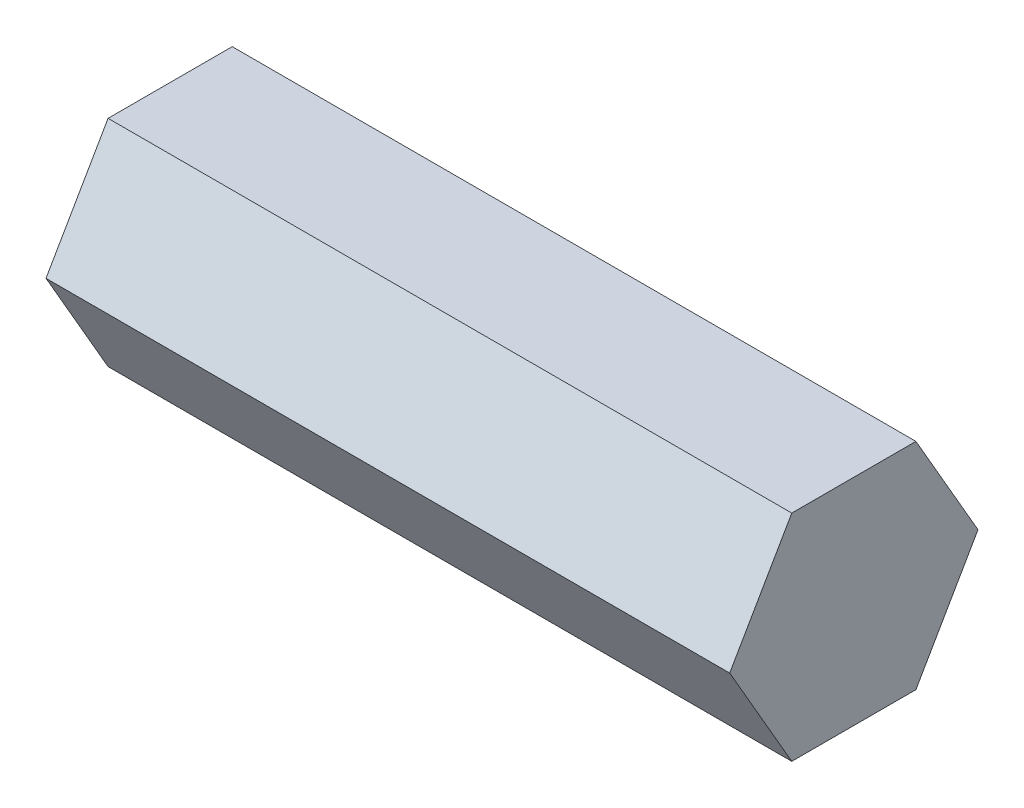
ISO-10303-21;
HEADER;
FILE_DESCRIPTION(('STEP AP214'),'2;1');
FILE_NAME('part.step','',(''),(''),'','','');
FILE_SCHEMA(('AUTOMOTIVE_DESIGN { 1 0 10303 214 1 1 1 1 }'));
ENDSEC;
DATA;
#1=APPLICATION_CONTEXT('core data for automotive mechanical design processes');
#2=APPLICATION_PROTOCOL_DEFINITION('international standard','automotive_design',2000,#1);
#3=PRODUCT_CONTEXT('',#1,'mechanical');
#4=PRODUCT('Part','Part','',(#3));
#5=PRODUCT_RELATED_PRODUCT_CATEGORY('part','',(#4));
#6=PRODUCT_DEFINITION_FORMATION('','',#4);
#7=PRODUCT_DEFINITION_CONTEXT('part definition',#1,'design');
#8=PRODUCT_DEFINITION('design','',#6,#7);
#9=PRODUCT_DEFINITION_SHAPE('','',#8);
#10=(LENGTH_UNIT() NAMED_UNIT(*) SI_UNIT(.MILLI.,.METRE.));
#11=(NAMED_UNIT(*) PLANE_ANGLE_UNIT() SI_UNIT($,.RADIAN.));
#12=(NAMED_UNIT(*) SI_UNIT($,.STERADIAN.) SOLID_ANGLE_UNIT());
#13=UNCERTAINTY_MEASURE_WITH_UNIT(LENGTH_MEASURE(1.E-05),#10,'distance_accuracy_value','');
#14=(GEOMETRIC_REPRESENTATION_CONTEXT(3) GLOBAL_UNCERTAINTY_ASSIGNED_CONTEXT((#13)) GLOBAL_UNIT_ASSIGNED_CONTEXT((#10,
#11,#12)) REPRESENTATION_CONTEXT('',''));
#15=CARTESIAN_POINT('',(0.,0.,0.));
#16=DIRECTION('',(0.,0.,1.));
#17=DIRECTION('',(1.,0.,0.));
#18=AXIS2_PLACEMENT_3D('',#15,#16,#17);
#19=CARTESIAN_POINT('',(40.38,-6.34999999999996,-3.6661742093542));
#20=DIRECTION('',(0.,0.499999999999995,0.866025403784442));
#21=DIRECTION('',(0.,-0.866025403784442,0.499999999999995));
#22=AXIS2_PLACEMENT_3D('',#19,#20,#21);
#23=PLANE('',#22);
#24=DIRECTION('',(0.,0.866025403784442,-0.499999999999995));
#25=VECTOR('',#24,1.);
#26=CARTESIAN_POINT('',(0.,-6.34999999999996,-3.6661742093542));
#27=LINE('',#26,#25);
#28=CARTESIAN_POINT('',(0.,-6.34999999999996,-3.6661742093542));
#29=VERTEX_POINT('',#28);
#30=CARTESIAN_POINT('',(0.,0.,-7.33234841870825));
#31=VERTEX_POINT('',#30);
#32=EDGE_CURVE('E123',#29,#31,#27,.T.);
#33=ORIENTED_EDGE('',*,*,#32,.T.);
#34=DIRECTION('',(-1.,0.,0.));
#35=VECTOR('',#34,1.);
#36=CARTESIAN_POINT('',(40.38,0.,-7.33234841870825));
#37=LINE('',#36,#35);
#38=CARTESIAN_POINT('',(40.38,0.,-7.33234841870825));
#39=VERTEX_POINT('',#38);
#40=EDGE_CURVE('E11',#39,#31,#37,.T.);
#41=ORIENTED_EDGE('',*,*,#40,.F.);
#42=DIRECTION('',(0.,0.866025403784442,-0.499999999999995));
#43=VECTOR('',#42,1.);
#44=CARTESIAN_POINT('',(40.38,-6.34999999999996,-3.6661742093542));
#45=LINE('',#44,#43);
#46=CARTESIAN_POINT('',(40.38,-6.34999999999996,-3.6661742093542));
#47=VERTEX_POINT('',#46);
#48=EDGE_CURVE('E135',#47,#39,#45,.T.);
#49=ORIENTED_EDGE('',*,*,#48,.F.);
#50=DIRECTION('',(-1.,0.,0.));
#51=VECTOR('',#50,1.);
#52=CARTESIAN_POINT('',(40.38,-6.34999999999996,-3.6661742093542));
#53=LINE('',#52,#51);
#54=EDGE_CURVE('E118',#47,#29,#53,.T.);
#55=ORIENTED_EDGE('',*,*,#54,.T.);
#56=EDGE_LOOP('',(#33,#41,#49,#55));
#57=FACE_BOUND('',#56,.T.);
#58=ADVANCED_FACE('F39',(#57),#23,.F.);
#59=CARTESIAN_POINT('',(40.38,0.,-7.33234841870825));
#60=DIRECTION('',(0.,-0.500000000000001,0.866025403784438));
#61=DIRECTION('',(0.,-0.866025403784438,-0.500000000000001));
#62=AXIS2_PLACEMENT_3D('',#59,#60,#61);
#63=PLANE('',#62);
#64=DIRECTION('',(0.,0.866025403784438,0.500000000000001));
#65=VECTOR('',#64,1.);
#66=CARTESIAN_POINT('',(0.,0.,-7.33234841870825));
#67=LINE('',#66,#65);
#68=CARTESIAN_POINT('',(0.,6.35000000000001,-3.66617420935411));
#69=VERTEX_POINT('',#68);
#70=EDGE_CURVE('E127',#31,#69,#67,.T.);
#71=ORIENTED_EDGE('',*,*,#70,.T.);
#72=DIRECTION('',(-1.,0.,0.));
#73=VECTOR('',#72,1.);
#74=CARTESIAN_POINT('',(40.38,6.35000000000001,-3.66617420935411));
#75=LINE('',#74,#73);
#76=CARTESIAN_POINT('',(40.38,6.35000000000001,-3.66617420935411));
#77=VERTEX_POINT('',#76);
#78=EDGE_CURVE('E50',#77,#69,#75,.T.);
#79=ORIENTED_EDGE('',*,*,#78,.F.);
#80=DIRECTION('',(0.,0.866025403784438,0.500000000000001));
#81=VECTOR('',#80,1.);
#82=CARTESIAN_POINT('',(40.38,0.,-7.33234841870825));
#83=LINE('',#82,#81);
#84=EDGE_CURVE('E95',#39,#77,#83,.T.);
#85=ORIENTED_EDGE('',*,*,#84,.F.);
#86=ORIENTED_EDGE('',*,*,#40,.T.);
#87=EDGE_LOOP('',(#71,#79,#85,#86));
#88=FACE_BOUND('',#87,.T.);
#89=ADVANCED_FACE('F160',(#88),#63,.F.);
#90=CARTESIAN_POINT('',(40.38,6.35000000000001,-3.66617420935411));
#91=DIRECTION('',(0.,-1.,0.));
#92=DIRECTION('',(0.,0.,-1.));
#93=AXIS2_PLACEMENT_3D('',#90,#91,#92);
#94=PLANE('',#93);
#95=DIRECTION('',(0.,0.,1.));
#96=VECTOR('',#95,1.);
#97=CARTESIAN_POINT('',(0.,6.35000000000001,-3.66617420935411));
#98=LINE('',#97,#96);
#99=CARTESIAN_POINT('',(0.,6.34999999999999,3.66617420935415));
#100=VERTEX_POINT('',#99);
#101=EDGE_CURVE('E126',#69,#100,#98,.T.);
#102=ORIENTED_EDGE('',*,*,#101,.T.);
#103=DIRECTION('',(-1.,0.,0.));
#104=VECTOR('',#103,1.);
#105=CARTESIAN_POINT('',(40.38,6.34999999999999,3.66617420935415));
#106=LINE('',#105,#104);
#107=CARTESIAN_POINT('',(40.38,6.34999999999999,3.66617420935415));
#108=VERTEX_POINT('',#107);
#109=EDGE_CURVE('E111',#108,#100,#106,.T.);
#110=ORIENTED_EDGE('',*,*,#109,.F.);
#111=DIRECTION('',(0.,0.,1.));
#112=VECTOR('',#111,1.);
#113=CARTESIAN_POINT('',(40.38,6.35000000000001,-3.66617420935411));
#114=LINE('',#113,#112);
#115=EDGE_CURVE('E104',#77,#108,#114,.T.);
#116=ORIENTED_EDGE('',*,*,#115,.F.);
#117=ORIENTED_EDGE('',*,*,#78,.T.);
#118=EDGE_LOOP('',(#102,#110,#116,#117));
#119=FACE_BOUND('',#118,.T.);
#120=ADVANCED_FACE('F139',(#119),#94,.F.);
#121=CARTESIAN_POINT('',(40.38,6.34999999999999,3.66617420935415));
#122=DIRECTION('',(0.,-0.499999999999995,-0.866025403784442));
#123=DIRECTION('',(0.,0.866025403784442,-0.499999999999995));
#124=AXIS2_PLACEMENT_3D('',#121,#122,#123);
#125=PLANE('',#124);
#126=DIRECTION('',(0.,-0.866025403784442,0.499999999999995));
#127=VECTOR('',#126,1.);
#128=CARTESIAN_POINT('',(0.,6.34999999999999,3.66617420935415));
#129=LINE('',#128,#127);
#130=CARTESIAN_POINT('',(0.,0.,7.33234841870825));
#131=VERTEX_POINT('',#130);
#132=EDGE_CURVE('E114',#100,#131,#129,.T.);
#133=ORIENTED_EDGE('',*,*,#132,.T.);
#134=DIRECTION('',(-1.,0.,0.));
#135=VECTOR('',#134,1.);
#136=CARTESIAN_POINT('',(40.38,0.,7.33234841870825));
#137=LINE('',#136,#135);
#138=CARTESIAN_POINT('',(40.38,0.,7.33234841870825));
#139=VERTEX_POINT('',#138);
#140=EDGE_CURVE('E109',#139,#131,#137,.T.);
#141=ORIENTED_EDGE('',*,*,#140,.F.);
#142=DIRECTION('',(0.,-0.866025403784442,0.499999999999995));
#143=VECTOR('',#142,1.);
#144=CARTESIAN_POINT('',(40.38,6.34999999999999,3.66617420935415));
#145=LINE('',#144,#143);
#146=EDGE_CURVE('E97',#108,#139,#145,.T.);
#147=ORIENTED_EDGE('',*,*,#146,.F.);
#148=ORIENTED_EDGE('',*,*,#109,.T.);
#149=EDGE_LOOP('',(#133,#141,#147,#148));
#150=FACE_BOUND('',#149,.T.);
#151=ADVANCED_FACE('F112',(#150),#125,.F.);
#152=CARTESIAN_POINT('',(40.38,0.,7.33234841870825));
#153=DIRECTION('',(0.,0.500000000000007,-0.866025403784434));
#154=DIRECTION('',(0.,0.866025403784435,0.500000000000007));
#155=AXIS2_PLACEMENT_3D('',#152,#153,#154);
#156=PLANE('',#155);
#157=DIRECTION('',(0.,-0.866025403784434,-0.500000000000007));
#158=VECTOR('',#157,1.);
#159=CARTESIAN_POINT('',(0.,0.,7.33234841870825));
#160=LINE('',#159,#158);
#161=CARTESIAN_POINT('',(0.,-6.35000000000004,3.66617420935407));
#162=VERTEX_POINT('',#161);
#163=EDGE_CURVE('E80',#131,#162,#160,.T.);
#164=ORIENTED_EDGE('',*,*,#163,.T.);
#165=DIRECTION('',(-1.,0.,0.));
#166=VECTOR('',#165,1.);
#167=CARTESIAN_POINT('',(40.38,-6.35000000000004,3.66617420935407));
#168=LINE('',#167,#166);
#169=CARTESIAN_POINT('',(40.38,-6.35000000000004,3.66617420935407));
#170=VERTEX_POINT('',#169);
#171=EDGE_CURVE('E113',#170,#162,#168,.T.);
#172=ORIENTED_EDGE('',*,*,#171,.F.);
#173=DIRECTION('',(0.,-0.866025403784434,-0.500000000000007));
#174=VECTOR('',#173,1.);
#175=CARTESIAN_POINT('',(40.38,0.,7.33234841870825));
#176=LINE('',#175,#174);
#177=EDGE_CURVE('E103',#139,#170,#176,.T.);
#178=ORIENTED_EDGE('',*,*,#177,.F.);
#179=ORIENTED_EDGE('',*,*,#140,.T.);
#180=EDGE_LOOP('',(#164,#172,#178,#179));
#181=FACE_BOUND('',#180,.T.);
#182=ADVANCED_FACE('F116',(#181),#156,.F.);
#183=CARTESIAN_POINT('',(40.38,-6.35000000000004,3.66617420935407));
#184=DIRECTION('',(0.,1.,0.));
#185=DIRECTION('',(0.,0.,1.));
#186=AXIS2_PLACEMENT_3D('',#183,#184,#185);
#187=PLANE('',#186);
#188=DIRECTION('',(0.,0.,-1.));
#189=VECTOR('',#188,1.);
#190=CARTESIAN_POINT('',(0.,-6.35000000000004,3.66617420935407));
#191=LINE('',#190,#189);
#192=EDGE_CURVE('E84',#162,#29,#191,.T.);
#193=ORIENTED_EDGE('',*,*,#192,.T.);
#194=ORIENTED_EDGE('',*,*,#54,.F.);
#195=DIRECTION('',(0.,0.,-1.));
#196=VECTOR('',#195,1.);
#197=CARTESIAN_POINT('',(40.38,-6.35000000000004,3.66617420935407));
#198=LINE('',#197,#196);
#199=EDGE_CURVE('E54',#170,#47,#198,.T.);
#200=ORIENTED_EDGE('',*,*,#199,.F.);
#201=ORIENTED_EDGE('',*,*,#171,.T.);
#202=EDGE_LOOP('',(#193,#194,#200,#201));
#203=FACE_BOUND('',#202,.T.);
#204=ADVANCED_FACE('F148',(#203),#187,.F.);
#205=CARTESIAN_POINT('',(40.38,0.,0.));
#206=DIRECTION('',(1.,0.,0.));
#207=DIRECTION('',(0.,0.,-1.));
#208=AXIS2_PLACEMENT_3D('',#205,#206,#207);
#209=PLANE('',#208);
#210=ORIENTED_EDGE('',*,*,#48,.T.);
#211=ORIENTED_EDGE('',*,*,#84,.T.);
#212=ORIENTED_EDGE('',*,*,#115,.T.);
#213=ORIENTED_EDGE('',*,*,#146,.T.);
#214=ORIENTED_EDGE('',*,*,#177,.T.);
#215=ORIENTED_EDGE('',*,*,#199,.T.);
#216=EDGE_LOOP('',(#210,#211,#212,#213,#214,#215));
#217=FACE_BOUND('',#216,.T.);
#218=ADVANCED_FACE('F101',(#217),#209,.T.);
#219=CARTESIAN_POINT('',(0.,0.,0.));
#220=DIRECTION('',(1.,0.,0.));
#221=DIRECTION('',(0.,0.,-1.));
#222=AXIS2_PLACEMENT_3D('',#219,#220,#221);
#223=PLANE('',#222);
#224=ORIENTED_EDGE('',*,*,#32,.F.);
#225=ORIENTED_EDGE('',*,*,#192,.F.);
#226=ORIENTED_EDGE('',*,*,#163,.F.);
#227=ORIENTED_EDGE('',*,*,#132,.F.);
#228=ORIENTED_EDGE('',*,*,#101,.F.);
#229=ORIENTED_EDGE('',*,*,#70,.F.);
#230=EDGE_LOOP('',(#224,#225,#226,#227,#228,#229));
#231=FACE_BOUND('',#230,.T.);
#232=ADVANCED_FACE('F142',(#231),#223,.F.);
#233=CLOSED_SHELL('',(#58,#89,#120,#151,#182,#204,#218,#232));
#234=MANIFOLD_SOLID_BREP('B2',#233);
#235=ADVANCED_BREP_SHAPE_REPRESENTATION('',(#18,#234),#14);
#236=SHAPE_DEFINITION_REPRESENTATION(#9,#235);
ENDSEC;
END-ISO-10303-21;
